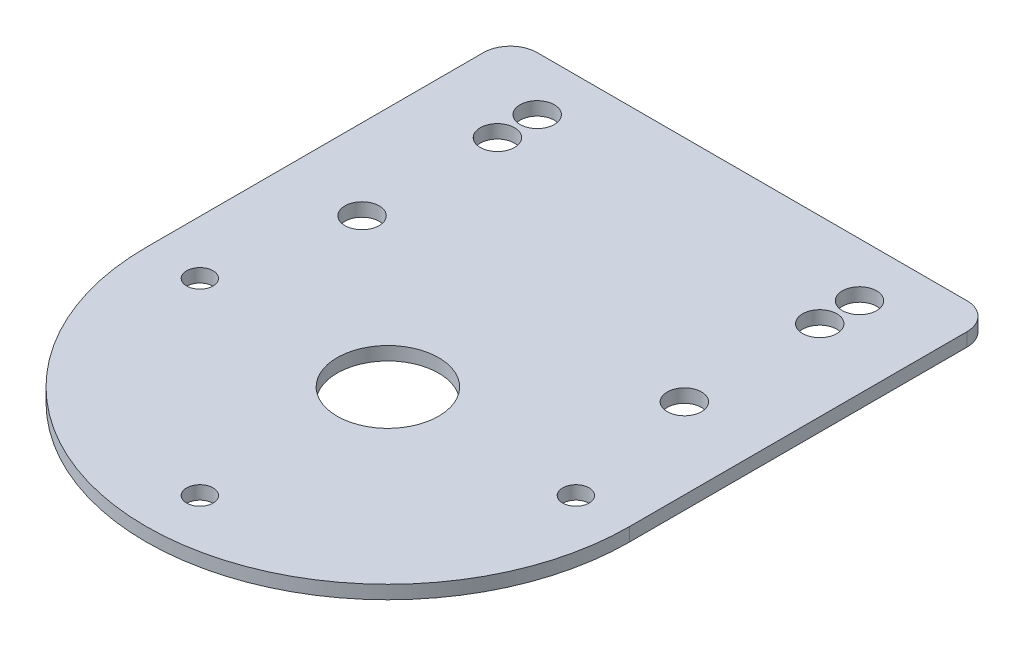
ISO-10303-21;
HEADER;
FILE_DESCRIPTION(('STEP AP214'),'2;1');
FILE_NAME('part.step','',(''),(''),'','','');
FILE_SCHEMA(('AUTOMOTIVE_DESIGN { 1 0 10303 214 1 1 1 1 }'));
ENDSEC;
DATA;
#1=APPLICATION_CONTEXT('core data for automotive mechanical design processes');
#2=APPLICATION_PROTOCOL_DEFINITION('international standard','automotive_design',2000,#1);
#3=PRODUCT_CONTEXT('',#1,'mechanical');
#4=PRODUCT('Part','Part','',(#3));
#5=PRODUCT_RELATED_PRODUCT_CATEGORY('part','',(#4));
#6=PRODUCT_DEFINITION_FORMATION('','',#4);
#7=PRODUCT_DEFINITION_CONTEXT('part definition',#1,'design');
#8=PRODUCT_DEFINITION('design','',#6,#7);
#9=PRODUCT_DEFINITION_SHAPE('','',#8);
#10=(LENGTH_UNIT() NAMED_UNIT(*) SI_UNIT(.MILLI.,.METRE.));
#11=(NAMED_UNIT(*) PLANE_ANGLE_UNIT() SI_UNIT($,.RADIAN.));
#12=(NAMED_UNIT(*) SI_UNIT($,.STERADIAN.) SOLID_ANGLE_UNIT());
#13=UNCERTAINTY_MEASURE_WITH_UNIT(LENGTH_MEASURE(1.E-05),#10,'distance_accuracy_value','');
#14=(GEOMETRIC_REPRESENTATION_CONTEXT(3) GLOBAL_UNCERTAINTY_ASSIGNED_CONTEXT((#13)) GLOBAL_UNIT_ASSIGNED_CONTEXT((#10,
#11,#12)) REPRESENTATION_CONTEXT('',''));
#15=CARTESIAN_POINT('',(0.,0.,0.));
#16=DIRECTION('',(0.,0.,1.));
#17=DIRECTION('',(1.,0.,0.));
#18=AXIS2_PLACEMENT_3D('',#15,#16,#17);
#19=CARTESIAN_POINT('',(0.,1.5875,0.));
#20=DIRECTION('',(0.,1.,0.));
#21=DIRECTION('',(0.,0.,1.));
#22=AXIS2_PLACEMENT_3D('',#19,#20,#21);
#23=PLANE('',#22);
#24=CARTESIAN_POINT('',(-19.05,1.5875,-32.));
#25=DIRECTION('',(0.,1.,0.));
#26=DIRECTION('',(0.,0.,1.));
#27=AXIS2_PLACEMENT_3D('',#24,#25,#26);
#28=CIRCLE('',#27,2.02499999999993);
#29=CARTESIAN_POINT('',(-19.05,1.5875,-29.9750000000001));
#30=VERTEX_POINT('',#29);
#31=EDGE_CURVE('E219',#30,#30,#28,.T.);
#32=ORIENTED_EDGE('',*,*,#31,.F.);
#33=EDGE_LOOP('',(#32));
#34=FACE_BOUND('',#33,.T.);
#35=CARTESIAN_POINT('',(-19.05,1.5875,-16.));
#36=DIRECTION('',(0.,1.,0.));
#37=DIRECTION('',(0.,0.,1.));
#38=AXIS2_PLACEMENT_3D('',#35,#36,#37);
#39=CIRCLE('',#38,2.025);
#40=CARTESIAN_POINT('',(-19.05,1.5875,-13.975));
#41=VERTEX_POINT('',#40);
#42=EDGE_CURVE('E231',#41,#41,#39,.T.);
#43=ORIENTED_EDGE('',*,*,#42,.F.);
#44=EDGE_LOOP('',(#43));
#45=FACE_BOUND('',#44,.T.);
#46=CARTESIAN_POINT('',(19.05,1.5875,-36.7));
#47=DIRECTION('',(0.,1.,0.));
#48=DIRECTION('',(0.,0.,-1.));
#49=AXIS2_PLACEMENT_3D('',#46,#47,#48);
#50=CIRCLE('',#49,2.025);
#51=CARTESIAN_POINT('',(19.05,1.5875,-38.725));
#52=VERTEX_POINT('',#51);
#53=EDGE_CURVE('E243',#52,#52,#50,.T.);
#54=ORIENTED_EDGE('',*,*,#53,.F.);
#55=EDGE_LOOP('',(#54));
#56=FACE_BOUND('',#55,.T.);
#57=CARTESIAN_POINT('',(0.,1.5875,22.225));
#58=DIRECTION('',(0.,1.,0.));
#59=DIRECTION('',(0.,0.,1.));
#60=AXIS2_PLACEMENT_3D('',#57,#58,#59);
#61=CIRCLE('',#60,1.5625);
#62=CARTESIAN_POINT('',(0.,1.5875,23.7875));
#63=VERTEX_POINT('',#62);
#64=EDGE_CURVE('E255',#63,#63,#61,.T.);
#65=ORIENTED_EDGE('',*,*,#64,.F.);
#66=EDGE_LOOP('',(#65));
#67=FACE_BOUND('',#66,.T.);
#68=CARTESIAN_POINT('',(0.,1.5875,0.));
#69=DIRECTION('',(0.,1.,0.));
#70=DIRECTION('',(0.,0.,1.));
#71=AXIS2_PLACEMENT_3D('',#68,#69,#70);
#72=CIRCLE('',#71,6.);
#73=CARTESIAN_POINT('',(0.,1.5875,6.));
#74=VERTEX_POINT('',#73);
#75=EDGE_CURVE('E128',#74,#74,#72,.T.);
#76=ORIENTED_EDGE('',*,*,#75,.F.);
#77=EDGE_LOOP('',(#76));
#78=FACE_BOUND('',#77,.T.);
#79=CARTESIAN_POINT('',(0.,1.5875,0.));
#80=DIRECTION('',(0.,1.,0.));
#81=DIRECTION('',(0.,0.,1.));
#82=AXIS2_PLACEMENT_3D('',#79,#80,#81);
#83=CIRCLE('',#82,28.575);
#84=CARTESIAN_POINT('',(-28.575,1.5875,0.));
#85=VERTEX_POINT('',#84);
#86=CARTESIAN_POINT('',(28.575,1.5875,0.));
#87=VERTEX_POINT('',#86);
#88=EDGE_CURVE('E135',#85,#87,#83,.T.);
#89=ORIENTED_EDGE('',*,*,#88,.T.);
#90=DIRECTION('',(0.,0.,-1.));
#91=VECTOR('',#90,1.);
#92=CARTESIAN_POINT('',(28.575,1.5875,-39.875));
#93=LINE('',#92,#91);
#94=CARTESIAN_POINT('',(28.575,1.5875,-39.875));
#95=VERTEX_POINT('',#94);
#96=EDGE_CURVE('E93',#87,#95,#93,.T.);
#97=ORIENTED_EDGE('',*,*,#96,.T.);
#98=CARTESIAN_POINT('',(25.4,1.5875,-39.875));
#99=DIRECTION('',(0.,1.,0.));
#100=DIRECTION('',(0.,0.,-1.));
#101=AXIS2_PLACEMENT_3D('',#98,#99,#100);
#102=CIRCLE('',#101,3.17499999999999);
#103=CARTESIAN_POINT('',(25.4,1.5875,-43.05));
#104=VERTEX_POINT('',#103);
#105=EDGE_CURVE('E106',#95,#104,#102,.T.);
#106=ORIENTED_EDGE('',*,*,#105,.T.);
#107=DIRECTION('',(-1.,0.,0.));
#108=VECTOR('',#107,1.);
#109=CARTESIAN_POINT('',(-25.4,1.5875,-43.05));
#110=LINE('',#109,#108);
#111=CARTESIAN_POINT('',(-25.4,1.5875,-43.05));
#112=VERTEX_POINT('',#111);
#113=EDGE_CURVE('E100',#104,#112,#110,.T.);
#114=ORIENTED_EDGE('',*,*,#113,.T.);
#115=CARTESIAN_POINT('',(-25.4,1.5875,-39.875));
#116=DIRECTION('',(0.,1.,0.));
#117=DIRECTION('',(0.,0.,-1.));
#118=AXIS2_PLACEMENT_3D('',#115,#116,#117);
#119=CIRCLE('',#118,3.17499999999999);
#120=CARTESIAN_POINT('',(-28.575,1.5875,-39.875));
#121=VERTEX_POINT('',#120);
#122=EDGE_CURVE('E104',#112,#121,#119,.T.);
#123=ORIENTED_EDGE('',*,*,#122,.T.);
#124=DIRECTION('',(0.,0.,1.));
#125=VECTOR('',#124,1.);
#126=CARTESIAN_POINT('',(-28.575,1.5875,0.));
#127=LINE('',#126,#125);
#128=EDGE_CURVE('E56',#121,#85,#127,.T.);
#129=ORIENTED_EDGE('',*,*,#128,.T.);
#130=EDGE_LOOP('',(#89,#97,#106,#114,#123,#129));
#131=FACE_BOUND('',#130,.T.);
#132=CARTESIAN_POINT('',(-22.225,1.5875,0.));
#133=DIRECTION('',(0.,1.,0.));
#134=DIRECTION('',(0.,0.,1.));
#135=AXIS2_PLACEMENT_3D('',#132,#133,#134);
#136=CIRCLE('',#135,1.5625);
#137=CARTESIAN_POINT('',(-22.225,1.5875,1.5625));
#138=VERTEX_POINT('',#137);
#139=EDGE_CURVE('E261',#138,#138,#136,.T.);
#140=ORIENTED_EDGE('',*,*,#139,.F.);
#141=EDGE_LOOP('',(#140));
#142=FACE_BOUND('',#141,.T.);
#143=CARTESIAN_POINT('',(22.225,1.5875,0.));
#144=DIRECTION('',(0.,1.,0.));
#145=DIRECTION('',(0.,0.,1.));
#146=AXIS2_PLACEMENT_3D('',#143,#144,#145);
#147=CIRCLE('',#146,1.5625);
#148=CARTESIAN_POINT('',(22.225,1.5875,1.5625));
#149=VERTEX_POINT('',#148);
#150=EDGE_CURVE('E249',#149,#149,#147,.T.);
#151=ORIENTED_EDGE('',*,*,#150,.F.);
#152=EDGE_LOOP('',(#151));
#153=FACE_BOUND('',#152,.T.);
#154=CARTESIAN_POINT('',(19.05,1.5875,-16.));
#155=DIRECTION('',(0.,1.,0.));
#156=DIRECTION('',(0.,0.,1.));
#157=AXIS2_PLACEMENT_3D('',#154,#155,#156);
#158=CIRCLE('',#157,2.02500000000007);
#159=CARTESIAN_POINT('',(19.05,1.5875,-13.9749999999999));
#160=VERTEX_POINT('',#159);
#161=EDGE_CURVE('E237',#160,#160,#158,.T.);
#162=ORIENTED_EDGE('',*,*,#161,.F.);
#163=EDGE_LOOP('',(#162));
#164=FACE_BOUND('',#163,.T.);
#165=CARTESIAN_POINT('',(19.05,1.5875,-32.));
#166=DIRECTION('',(0.,1.,0.));
#167=DIRECTION('',(0.,0.,1.));
#168=AXIS2_PLACEMENT_3D('',#165,#166,#167);
#169=CIRCLE('',#168,2.02499999999999);
#170=CARTESIAN_POINT('',(19.05,1.5875,-29.975));
#171=VERTEX_POINT('',#170);
#172=EDGE_CURVE('E225',#171,#171,#169,.T.);
#173=ORIENTED_EDGE('',*,*,#172,.F.);
#174=EDGE_LOOP('',(#173));
#175=FACE_BOUND('',#174,.T.);
#176=CARTESIAN_POINT('',(-19.05,1.5875,-36.7));
#177=DIRECTION('',(0.,1.,0.));
#178=DIRECTION('',(0.,0.,1.));
#179=AXIS2_PLACEMENT_3D('',#176,#177,#178);
#180=CIRCLE('',#179,2.025);
#181=CARTESIAN_POINT('',(-19.05,1.5875,-34.675));
#182=VERTEX_POINT('',#181);
#183=EDGE_CURVE('E210',#182,#182,#180,.T.);
#184=ORIENTED_EDGE('',*,*,#183,.F.);
#185=EDGE_LOOP('',(#184));
#186=FACE_BOUND('',#185,.T.);
#187=ADVANCED_FACE('F39',(#34,#45,#56,#67,#78,#131,#142,#153,#164,#175,#186),#23,.T.);
#188=CARTESIAN_POINT('',(0.,0.,0.));
#189=DIRECTION('',(0.,1.,0.));
#190=DIRECTION('',(0.,0.,1.));
#191=AXIS2_PLACEMENT_3D('',#188,#189,#190);
#192=PLANE('',#191);
#193=CARTESIAN_POINT('',(0.,0.,0.));
#194=DIRECTION('',(0.,1.,0.));
#195=DIRECTION('',(0.,0.,1.));
#196=AXIS2_PLACEMENT_3D('',#193,#194,#195);
#197=CIRCLE('',#196,28.575);
#198=CARTESIAN_POINT('',(-28.575,0.,0.));
#199=VERTEX_POINT('',#198);
#200=CARTESIAN_POINT('',(28.575,0.,0.));
#201=VERTEX_POINT('',#200);
#202=EDGE_CURVE('E124',#199,#201,#197,.T.);
#203=ORIENTED_EDGE('',*,*,#202,.F.);
#204=DIRECTION('',(0.,0.,1.));
#205=VECTOR('',#204,1.);
#206=CARTESIAN_POINT('',(-28.575,0.,0.));
#207=LINE('',#206,#205);
#208=CARTESIAN_POINT('',(-28.575,0.,-39.875));
#209=VERTEX_POINT('',#208);
#210=EDGE_CURVE('E85',#209,#199,#207,.T.);
#211=ORIENTED_EDGE('',*,*,#210,.F.);
#212=CARTESIAN_POINT('',(-25.4,0.,-39.875));
#213=DIRECTION('',(0.,1.,0.));
#214=DIRECTION('',(0.,0.,-1.));
#215=AXIS2_PLACEMENT_3D('',#212,#213,#214);
#216=CIRCLE('',#215,3.17499999999999);
#217=CARTESIAN_POINT('',(-25.4,0.,-43.05));
#218=VERTEX_POINT('',#217);
#219=EDGE_CURVE('E79',#218,#209,#216,.T.);
#220=ORIENTED_EDGE('',*,*,#219,.F.);
#221=DIRECTION('',(-1.,0.,0.));
#222=VECTOR('',#221,1.);
#223=CARTESIAN_POINT('',(-25.4,0.,-43.05));
#224=LINE('',#223,#222);
#225=CARTESIAN_POINT('',(25.4,0.,-43.05));
#226=VERTEX_POINT('',#225);
#227=EDGE_CURVE('E114',#226,#218,#224,.T.);
#228=ORIENTED_EDGE('',*,*,#227,.F.);
#229=CARTESIAN_POINT('',(25.4,0.,-39.875));
#230=DIRECTION('',(0.,1.,0.));
#231=DIRECTION('',(0.,0.,-1.));
#232=AXIS2_PLACEMENT_3D('',#229,#230,#231);
#233=CIRCLE('',#232,3.17499999999999);
#234=CARTESIAN_POINT('',(28.575,0.,-39.875));
#235=VERTEX_POINT('',#234);
#236=EDGE_CURVE('E130',#235,#226,#233,.T.);
#237=ORIENTED_EDGE('',*,*,#236,.F.);
#238=DIRECTION('',(0.,0.,-1.));
#239=VECTOR('',#238,1.);
#240=CARTESIAN_POINT('',(28.575,0.,-39.875));
#241=LINE('',#240,#239);
#242=EDGE_CURVE('E127',#201,#235,#241,.T.);
#243=ORIENTED_EDGE('',*,*,#242,.F.);
#244=EDGE_LOOP('',(#203,#211,#220,#228,#237,#243));
#245=FACE_BOUND('',#244,.T.);
#246=CARTESIAN_POINT('',(0.,0.,0.));
#247=DIRECTION('',(0.,1.,0.));
#248=DIRECTION('',(0.,0.,1.));
#249=AXIS2_PLACEMENT_3D('',#246,#247,#248);
#250=CIRCLE('',#249,6.);
#251=CARTESIAN_POINT('',(0.,0.,6.));
#252=VERTEX_POINT('',#251);
#253=EDGE_CURVE('E264',#252,#252,#250,.T.);
#254=ORIENTED_EDGE('',*,*,#253,.T.);
#255=EDGE_LOOP('',(#254));
#256=FACE_BOUND('',#255,.T.);
#257=CARTESIAN_POINT('',(-22.225,0.,0.));
#258=DIRECTION('',(0.,1.,0.));
#259=DIRECTION('',(0.,0.,1.));
#260=AXIS2_PLACEMENT_3D('',#257,#258,#259);
#261=CIRCLE('',#260,1.5625);
#262=CARTESIAN_POINT('',(-22.225,0.,1.5625));
#263=VERTEX_POINT('',#262);
#264=EDGE_CURVE('E258',#263,#263,#261,.T.);
#265=ORIENTED_EDGE('',*,*,#264,.T.);
#266=EDGE_LOOP('',(#265));
#267=FACE_BOUND('',#266,.T.);
#268=CARTESIAN_POINT('',(0.,0.,22.225));
#269=DIRECTION('',(0.,1.,0.));
#270=DIRECTION('',(0.,0.,1.));
#271=AXIS2_PLACEMENT_3D('',#268,#269,#270);
#272=CIRCLE('',#271,1.5625);
#273=CARTESIAN_POINT('',(0.,0.,23.7875));
#274=VERTEX_POINT('',#273);
#275=EDGE_CURVE('E252',#274,#274,#272,.T.);
#276=ORIENTED_EDGE('',*,*,#275,.T.);
#277=EDGE_LOOP('',(#276));
#278=FACE_BOUND('',#277,.T.);
#279=CARTESIAN_POINT('',(22.225,0.,0.));
#280=DIRECTION('',(0.,1.,0.));
#281=DIRECTION('',(0.,0.,1.));
#282=AXIS2_PLACEMENT_3D('',#279,#280,#281);
#283=CIRCLE('',#282,1.5625);
#284=CARTESIAN_POINT('',(22.225,0.,1.5625));
#285=VERTEX_POINT('',#284);
#286=EDGE_CURVE('E246',#285,#285,#283,.T.);
#287=ORIENTED_EDGE('',*,*,#286,.T.);
#288=EDGE_LOOP('',(#287));
#289=FACE_BOUND('',#288,.T.);
#290=CARTESIAN_POINT('',(19.05,0.,-36.7));
#291=DIRECTION('',(0.,1.,0.));
#292=DIRECTION('',(0.,0.,-1.));
#293=AXIS2_PLACEMENT_3D('',#290,#291,#292);
#294=CIRCLE('',#293,2.025);
#295=CARTESIAN_POINT('',(19.05,0.,-38.725));
#296=VERTEX_POINT('',#295);
#297=EDGE_CURVE('E240',#296,#296,#294,.T.);
#298=ORIENTED_EDGE('',*,*,#297,.T.);
#299=EDGE_LOOP('',(#298));
#300=FACE_BOUND('',#299,.T.);
#301=CARTESIAN_POINT('',(19.05,0.,-16.));
#302=DIRECTION('',(0.,1.,0.));
#303=DIRECTION('',(0.,0.,1.));
#304=AXIS2_PLACEMENT_3D('',#301,#302,#303);
#305=CIRCLE('',#304,2.02500000000007);
#306=CARTESIAN_POINT('',(19.05,0.,-13.9749999999999));
#307=VERTEX_POINT('',#306);
#308=EDGE_CURVE('E234',#307,#307,#305,.T.);
#309=ORIENTED_EDGE('',*,*,#308,.T.);
#310=EDGE_LOOP('',(#309));
#311=FACE_BOUND('',#310,.T.);
#312=CARTESIAN_POINT('',(-19.05,0.,-16.));
#313=DIRECTION('',(0.,1.,0.));
#314=DIRECTION('',(0.,0.,1.));
#315=AXIS2_PLACEMENT_3D('',#312,#313,#314);
#316=CIRCLE('',#315,2.025);
#317=CARTESIAN_POINT('',(-19.05,0.,-13.975));
#318=VERTEX_POINT('',#317);
#319=EDGE_CURVE('E228',#318,#318,#316,.T.);
#320=ORIENTED_EDGE('',*,*,#319,.T.);
#321=EDGE_LOOP('',(#320));
#322=FACE_BOUND('',#321,.T.);
#323=CARTESIAN_POINT('',(19.05,0.,-32.));
#324=DIRECTION('',(0.,1.,0.));
#325=DIRECTION('',(0.,0.,1.));
#326=AXIS2_PLACEMENT_3D('',#323,#324,#325);
#327=CIRCLE('',#326,2.02499999999999);
#328=CARTESIAN_POINT('',(19.05,0.,-29.975));
#329=VERTEX_POINT('',#328);
#330=EDGE_CURVE('E222',#329,#329,#327,.T.);
#331=ORIENTED_EDGE('',*,*,#330,.T.);
#332=EDGE_LOOP('',(#331));
#333=FACE_BOUND('',#332,.T.);
#334=CARTESIAN_POINT('',(-19.05,0.,-32.));
#335=DIRECTION('',(0.,1.,0.));
#336=DIRECTION('',(0.,0.,1.));
#337=AXIS2_PLACEMENT_3D('',#334,#335,#336);
#338=CIRCLE('',#337,2.02499999999993);
#339=CARTESIAN_POINT('',(-19.05,0.,-29.9750000000001));
#340=VERTEX_POINT('',#339);
#341=EDGE_CURVE('E216',#340,#340,#338,.T.);
#342=ORIENTED_EDGE('',*,*,#341,.T.);
#343=EDGE_LOOP('',(#342));
#344=FACE_BOUND('',#343,.T.);
#345=CARTESIAN_POINT('',(-19.05,0.,-36.7));
#346=DIRECTION('',(0.,1.,0.));
#347=DIRECTION('',(0.,0.,1.));
#348=AXIS2_PLACEMENT_3D('',#345,#346,#347);
#349=CIRCLE('',#348,2.025);
#350=CARTESIAN_POINT('',(-19.05,0.,-34.675));
#351=VERTEX_POINT('',#350);
#352=EDGE_CURVE('E213',#351,#351,#349,.T.);
#353=ORIENTED_EDGE('',*,*,#352,.T.);
#354=EDGE_LOOP('',(#353));
#355=FACE_BOUND('',#354,.T.);
#356=ADVANCED_FACE('F144',(#245,#256,#267,#278,#289,#300,#311,#322,#333,#344,#355),#192,.F.);
#357=CARTESIAN_POINT('',(0.,1.5875,0.));
#358=DIRECTION('',(0.,-1.,0.));
#359=DIRECTION('',(0.,0.,-1.));
#360=AXIS2_PLACEMENT_3D('',#357,#358,#359);
#361=CYLINDRICAL_SURFACE('',#360,28.575);
#362=ORIENTED_EDGE('',*,*,#202,.T.);
#363=DIRECTION('',(0.,-1.,0.));
#364=VECTOR('',#363,1.);
#365=CARTESIAN_POINT('',(28.575,1.5875,0.));
#366=LINE('',#365,#364);
#367=EDGE_CURVE('E11',#87,#201,#366,.T.);
#368=ORIENTED_EDGE('',*,*,#367,.F.);
#369=ORIENTED_EDGE('',*,*,#88,.F.);
#370=DIRECTION('',(0.,-1.,0.));
#371=VECTOR('',#370,1.);
#372=CARTESIAN_POINT('',(-28.575,1.5875,0.));
#373=LINE('',#372,#371);
#374=EDGE_CURVE('E120',#85,#199,#373,.T.);
#375=ORIENTED_EDGE('',*,*,#374,.T.);
#376=EDGE_LOOP('',(#362,#368,#369,#375));
#377=FACE_BOUND('',#376,.T.);
#378=ADVANCED_FACE('F41',(#377),#361,.T.);
#379=CARTESIAN_POINT('',(28.575,1.5875,-39.875));
#380=DIRECTION('',(-1.,0.,0.));
#381=DIRECTION('',(0.,0.,1.));
#382=AXIS2_PLACEMENT_3D('',#379,#380,#381);
#383=PLANE('',#382);
#384=ORIENTED_EDGE('',*,*,#242,.T.);
#385=DIRECTION('',(0.,-1.,0.));
#386=VECTOR('',#385,1.);
#387=CARTESIAN_POINT('',(28.575,1.5875,-39.875));
#388=LINE('',#387,#386);
#389=EDGE_CURVE('E48',#95,#235,#388,.T.);
#390=ORIENTED_EDGE('',*,*,#389,.F.);
#391=ORIENTED_EDGE('',*,*,#96,.F.);
#392=ORIENTED_EDGE('',*,*,#367,.T.);
#393=EDGE_LOOP('',(#384,#390,#391,#392));
#394=FACE_BOUND('',#393,.T.);
#395=ADVANCED_FACE('F386',(#394),#383,.F.);
#396=CARTESIAN_POINT('',(25.4,1.5875,-39.875));
#397=DIRECTION('',(0.,-1.,0.));
#398=DIRECTION('',(0.,0.,-1.));
#399=AXIS2_PLACEMENT_3D('',#396,#397,#398);
#400=CYLINDRICAL_SURFACE('',#399,3.17499999999999);
#401=ORIENTED_EDGE('',*,*,#236,.T.);
#402=DIRECTION('',(0.,-1.,0.));
#403=VECTOR('',#402,1.);
#404=CARTESIAN_POINT('',(25.4,1.5875,-43.05));
#405=LINE('',#404,#403);
#406=EDGE_CURVE('E115',#104,#226,#405,.T.);
#407=ORIENTED_EDGE('',*,*,#406,.F.);
#408=ORIENTED_EDGE('',*,*,#105,.F.);
#409=ORIENTED_EDGE('',*,*,#389,.T.);
#410=EDGE_LOOP('',(#401,#407,#408,#409));
#411=FACE_BOUND('',#410,.T.);
#412=ADVANCED_FACE('F141',(#411),#400,.T.);
#413=CARTESIAN_POINT('',(-25.4,1.5875,-43.05));
#414=DIRECTION('',(0.,0.,1.));
#415=DIRECTION('',(1.,0.,0.));
#416=AXIS2_PLACEMENT_3D('',#413,#414,#415);
#417=PLANE('',#416);
#418=ORIENTED_EDGE('',*,*,#227,.T.);
#419=DIRECTION('',(0.,-1.,0.));
#420=VECTOR('',#419,1.);
#421=CARTESIAN_POINT('',(-25.4,1.5875,-43.05));
#422=LINE('',#421,#420);
#423=EDGE_CURVE('E111',#112,#218,#422,.T.);
#424=ORIENTED_EDGE('',*,*,#423,.F.);
#425=ORIENTED_EDGE('',*,*,#113,.F.);
#426=ORIENTED_EDGE('',*,*,#406,.T.);
#427=EDGE_LOOP('',(#418,#424,#425,#426));
#428=FACE_BOUND('',#427,.T.);
#429=ADVANCED_FACE('F112',(#428),#417,.F.);
#430=CARTESIAN_POINT('',(-25.4,1.5875,-39.875));
#431=DIRECTION('',(0.,-1.,0.));
#432=DIRECTION('',(0.,0.,-1.));
#433=AXIS2_PLACEMENT_3D('',#430,#431,#432);
#434=CYLINDRICAL_SURFACE('',#433,3.17499999999999);
#435=ORIENTED_EDGE('',*,*,#219,.T.);
#436=DIRECTION('',(0.,-1.,0.));
#437=VECTOR('',#436,1.);
#438=CARTESIAN_POINT('',(-28.575,1.5875,-39.875));
#439=LINE('',#438,#437);
#440=EDGE_CURVE('E116',#121,#209,#439,.T.);
#441=ORIENTED_EDGE('',*,*,#440,.F.);
#442=ORIENTED_EDGE('',*,*,#122,.F.);
#443=ORIENTED_EDGE('',*,*,#423,.T.);
#444=EDGE_LOOP('',(#435,#441,#442,#443));
#445=FACE_BOUND('',#444,.T.);
#446=ADVANCED_FACE('F118',(#445),#434,.T.);
#447=CARTESIAN_POINT('',(-28.575,1.5875,0.));
#448=DIRECTION('',(1.,0.,0.));
#449=DIRECTION('',(0.,0.,-1.));
#450=AXIS2_PLACEMENT_3D('',#447,#448,#449);
#451=PLANE('',#450);
#452=ORIENTED_EDGE('',*,*,#210,.T.);
#453=ORIENTED_EDGE('',*,*,#374,.F.);
#454=ORIENTED_EDGE('',*,*,#128,.F.);
#455=ORIENTED_EDGE('',*,*,#440,.T.);
#456=EDGE_LOOP('',(#452,#453,#454,#455));
#457=FACE_BOUND('',#456,.T.);
#458=ADVANCED_FACE('F149',(#457),#451,.F.);
#459=CARTESIAN_POINT('',(0.,1.5875,0.));
#460=DIRECTION('',(0.,-1.,0.));
#461=DIRECTION('',(0.,0.,-1.));
#462=AXIS2_PLACEMENT_3D('',#459,#460,#461);
#463=CYLINDRICAL_SURFACE('',#462,6.);
#464=ORIENTED_EDGE('',*,*,#75,.T.);
#465=EDGE_LOOP('',(#464));
#466=FACE_BOUND('',#465,.T.);
#467=ORIENTED_EDGE('',*,*,#253,.F.);
#468=EDGE_LOOP('',(#467));
#469=FACE_BOUND('',#468,.T.);
#470=ADVANCED_FACE('F151',(#466,#469),#463,.F.);
#471=CARTESIAN_POINT('',(-22.225,1.5875,0.));
#472=DIRECTION('',(0.,-1.,0.));
#473=DIRECTION('',(0.,0.,-1.));
#474=AXIS2_PLACEMENT_3D('',#471,#472,#473);
#475=CYLINDRICAL_SURFACE('',#474,1.5625);
#476=ORIENTED_EDGE('',*,*,#139,.T.);
#477=EDGE_LOOP('',(#476));
#478=FACE_BOUND('',#477,.T.);
#479=ORIENTED_EDGE('',*,*,#264,.F.);
#480=EDGE_LOOP('',(#479));
#481=FACE_BOUND('',#480,.T.);
#482=ADVANCED_FACE('F157',(#478,#481),#475,.F.);
#483=CARTESIAN_POINT('',(0.,1.5875,22.225));
#484=DIRECTION('',(0.,-1.,0.));
#485=DIRECTION('',(0.,0.,-1.));
#486=AXIS2_PLACEMENT_3D('',#483,#484,#485);
#487=CYLINDRICAL_SURFACE('',#486,1.5625);
#488=ORIENTED_EDGE('',*,*,#64,.T.);
#489=EDGE_LOOP('',(#488));
#490=FACE_BOUND('',#489,.T.);
#491=ORIENTED_EDGE('',*,*,#275,.F.);
#492=EDGE_LOOP('',(#491));
#493=FACE_BOUND('',#492,.T.);
#494=ADVANCED_FACE('F173',(#490,#493),#487,.F.);
#495=CARTESIAN_POINT('',(22.225,1.5875,0.));
#496=DIRECTION('',(0.,-1.,0.));
#497=DIRECTION('',(0.,0.,-1.));
#498=AXIS2_PLACEMENT_3D('',#495,#496,#497);
#499=CYLINDRICAL_SURFACE('',#498,1.5625);
#500=ORIENTED_EDGE('',*,*,#150,.T.);
#501=EDGE_LOOP('',(#500));
#502=FACE_BOUND('',#501,.T.);
#503=ORIENTED_EDGE('',*,*,#286,.F.);
#504=EDGE_LOOP('',(#503));
#505=FACE_BOUND('',#504,.T.);
#506=ADVANCED_FACE('F177',(#502,#505),#499,.F.);
#507=CARTESIAN_POINT('',(19.05,1.5875,-36.7));
#508=DIRECTION('',(0.,-1.,0.));
#509=DIRECTION('',(0.,0.,-1.));
#510=AXIS2_PLACEMENT_3D('',#507,#508,#509);
#511=CYLINDRICAL_SURFACE('',#510,2.025);
#512=ORIENTED_EDGE('',*,*,#53,.T.);
#513=EDGE_LOOP('',(#512));
#514=FACE_BOUND('',#513,.T.);
#515=ORIENTED_EDGE('',*,*,#297,.F.);
#516=EDGE_LOOP('',(#515));
#517=FACE_BOUND('',#516,.T.);
#518=ADVANCED_FACE('F181',(#514,#517),#511,.F.);
#519=CARTESIAN_POINT('',(19.05,1.5875,-16.));
#520=DIRECTION('',(0.,-1.,0.));
#521=DIRECTION('',(0.,0.,-1.));
#522=AXIS2_PLACEMENT_3D('',#519,#520,#521);
#523=CYLINDRICAL_SURFACE('',#522,2.02500000000007);
#524=ORIENTED_EDGE('',*,*,#161,.T.);
#525=EDGE_LOOP('',(#524));
#526=FACE_BOUND('',#525,.T.);
#527=ORIENTED_EDGE('',*,*,#308,.F.);
#528=EDGE_LOOP('',(#527));
#529=FACE_BOUND('',#528,.T.);
#530=ADVANCED_FACE('F185',(#526,#529),#523,.F.);
#531=CARTESIAN_POINT('',(-19.05,1.5875,-16.));
#532=DIRECTION('',(0.,-1.,0.));
#533=DIRECTION('',(0.,0.,-1.));
#534=AXIS2_PLACEMENT_3D('',#531,#532,#533);
#535=CYLINDRICAL_SURFACE('',#534,2.025);
#536=ORIENTED_EDGE('',*,*,#42,.T.);
#537=EDGE_LOOP('',(#536));
#538=FACE_BOUND('',#537,.T.);
#539=ORIENTED_EDGE('',*,*,#319,.F.);
#540=EDGE_LOOP('',(#539));
#541=FACE_BOUND('',#540,.T.);
#542=ADVANCED_FACE('F189',(#538,#541),#535,.F.);
#543=CARTESIAN_POINT('',(19.05,1.5875,-32.));
#544=DIRECTION('',(0.,-1.,0.));
#545=DIRECTION('',(0.,0.,-1.));
#546=AXIS2_PLACEMENT_3D('',#543,#544,#545);
#547=CYLINDRICAL_SURFACE('',#546,2.02499999999999);
#548=ORIENTED_EDGE('',*,*,#172,.T.);
#549=EDGE_LOOP('',(#548));
#550=FACE_BOUND('',#549,.T.);
#551=ORIENTED_EDGE('',*,*,#330,.F.);
#552=EDGE_LOOP('',(#551));
#553=FACE_BOUND('',#552,.T.);
#554=ADVANCED_FACE('F193',(#550,#553),#547,.F.);
#555=CARTESIAN_POINT('',(-19.05,1.5875,-32.));
#556=DIRECTION('',(0.,-1.,0.));
#557=DIRECTION('',(0.,0.,-1.));
#558=AXIS2_PLACEMENT_3D('',#555,#556,#557);
#559=CYLINDRICAL_SURFACE('',#558,2.02499999999993);
#560=ORIENTED_EDGE('',*,*,#31,.T.);
#561=EDGE_LOOP('',(#560));
#562=FACE_BOUND('',#561,.T.);
#563=ORIENTED_EDGE('',*,*,#341,.F.);
#564=EDGE_LOOP('',(#563));
#565=FACE_BOUND('',#564,.T.);
#566=ADVANCED_FACE('F197',(#562,#565),#559,.F.);
#567=CARTESIAN_POINT('',(-19.05,1.5875,-36.7));
#568=DIRECTION('',(0.,-1.,0.));
#569=DIRECTION('',(0.,0.,-1.));
#570=AXIS2_PLACEMENT_3D('',#567,#568,#569);
#571=CYLINDRICAL_SURFACE('',#570,2.025);
#572=ORIENTED_EDGE('',*,*,#183,.T.);
#573=EDGE_LOOP('',(#572));
#574=FACE_BOUND('',#573,.T.);
#575=ORIENTED_EDGE('',*,*,#352,.F.);
#576=EDGE_LOOP('',(#575));
#577=FACE_BOUND('',#576,.T.);
#578=ADVANCED_FACE('F201',(#574,#577),#571,.F.);
#579=CLOSED_SHELL('',(#187,#356,#378,#395,#412,#429,#446,#458,#470,#482,#494,#506,#518,#530,
#542,#554,#566,#578));
#580=MANIFOLD_SOLID_BREP('B2',#579);
#581=ADVANCED_BREP_SHAPE_REPRESENTATION('',(#18,#580),#14);
#582=SHAPE_DEFINITION_REPRESENTATION(#9,#581);
ENDSEC;
END-ISO-10303-21;
